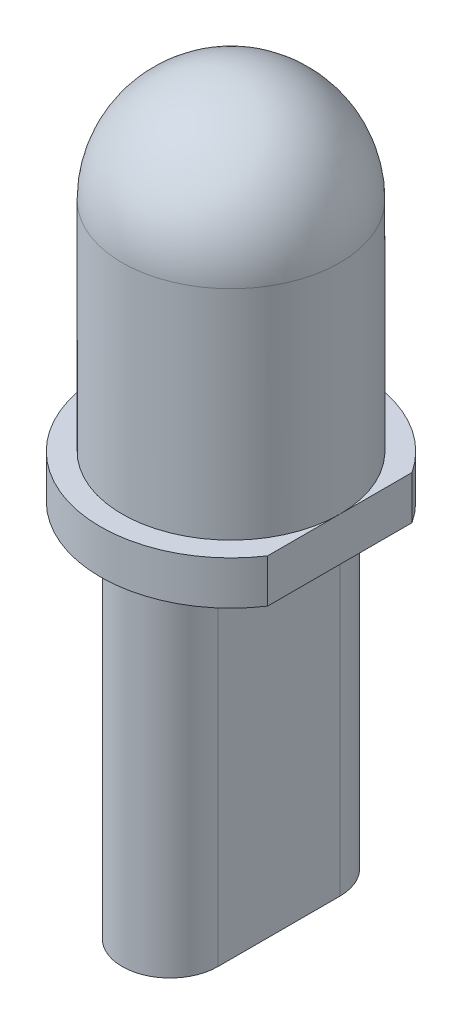
ISO-10303-21;
HEADER;
FILE_DESCRIPTION(('STEP AP214'),'2;1');
FILE_NAME('part.step','',(''),(''),'','','');
FILE_SCHEMA(('AUTOMOTIVE_DESIGN { 1 0 10303 214 1 1 1 1 }'));
ENDSEC;
DATA;
#1=APPLICATION_CONTEXT('core data for automotive mechanical design processes');
#2=APPLICATION_PROTOCOL_DEFINITION('international standard','automotive_design',2000,#1);
#3=PRODUCT_CONTEXT('',#1,'mechanical');
#4=PRODUCT('Part','Part','',(#3));
#5=PRODUCT_RELATED_PRODUCT_CATEGORY('part','',(#4));
#6=PRODUCT_DEFINITION_FORMATION('','',#4);
#7=PRODUCT_DEFINITION_CONTEXT('part definition',#1,'design');
#8=PRODUCT_DEFINITION('design','',#6,#7);
#9=PRODUCT_DEFINITION_SHAPE('','',#8);
#10=(LENGTH_UNIT() NAMED_UNIT(*) SI_UNIT(.MILLI.,.METRE.));
#11=(NAMED_UNIT(*) PLANE_ANGLE_UNIT() SI_UNIT($,.RADIAN.));
#12=(NAMED_UNIT(*) SI_UNIT($,.STERADIAN.) SOLID_ANGLE_UNIT());
#13=UNCERTAINTY_MEASURE_WITH_UNIT(LENGTH_MEASURE(1.E-05),#10,'distance_accuracy_value','');
#14=(GEOMETRIC_REPRESENTATION_CONTEXT(3) GLOBAL_UNCERTAINTY_ASSIGNED_CONTEXT((#13)) GLOBAL_UNIT_ASSIGNED_CONTEXT((#10,
#11,#12)) REPRESENTATION_CONTEXT('',''));
#15=CARTESIAN_POINT('',(0.,0.,0.));
#16=DIRECTION('',(0.,0.,1.));
#17=DIRECTION('',(1.,0.,0.));
#18=AXIS2_PLACEMENT_3D('',#15,#16,#17);
#19=CARTESIAN_POINT('',(0.,0.,0.));
#20=DIRECTION('',(0.,-1.,0.));
#21=DIRECTION('',(0.,0.,-1.));
#22=AXIS2_PLACEMENT_3D('',#19,#20,#21);
#23=PLANE('',#22);
#24=DIRECTION('',(0.,0.,1.));
#25=VECTOR('',#24,1.);
#26=CARTESIAN_POINT('',(2.5,0.,-1.6583123951777));
#27=LINE('',#26,#25);
#28=CARTESIAN_POINT('',(2.5,0.,-1.6583123951777));
#29=VERTEX_POINT('',#28);
#30=CARTESIAN_POINT('',(2.5,0.,1.6583123951777));
#31=VERTEX_POINT('',#30);
#32=EDGE_CURVE('E122',#29,#31,#27,.T.);
#33=ORIENTED_EDGE('',*,*,#32,.T.);
#34=CARTESIAN_POINT('',(0.,0.,0.));
#35=DIRECTION('',(0.,-1.,0.));
#36=DIRECTION('',(0.,0.,-1.));
#37=AXIS2_PLACEMENT_3D('',#34,#35,#36);
#38=CIRCLE('',#37,3.);
#39=EDGE_CURVE('E126',#31,#29,#38,.T.);
#40=ORIENTED_EDGE('',*,*,#39,.T.);
#41=EDGE_LOOP('',(#33,#40));
#42=FACE_BOUND('',#41,.T.);
#43=DIRECTION('',(0.,0.,-1.));
#44=VECTOR('',#43,1.);
#45=CARTESIAN_POINT('',(-1.1,0.,1.4));
#46=LINE('',#45,#44);
#47=CARTESIAN_POINT('',(-1.1,0.,1.4));
#48=VERTEX_POINT('',#47);
#49=CARTESIAN_POINT('',(-1.1,0.,-1.4));
#50=VERTEX_POINT('',#49);
#51=EDGE_CURVE('E157',#48,#50,#46,.T.);
#52=ORIENTED_EDGE('',*,*,#51,.F.);
#53=CARTESIAN_POINT('',(0.,0.,1.4));
#54=DIRECTION('',(0.,-1.,0.));
#55=DIRECTION('',(0.,0.,-1.));
#56=AXIS2_PLACEMENT_3D('',#53,#54,#55);
#57=CIRCLE('',#56,1.1);
#58=CARTESIAN_POINT('',(1.1,0.,1.4));
#59=VERTEX_POINT('',#58);
#60=EDGE_CURVE('E111',#59,#48,#57,.T.);
#61=ORIENTED_EDGE('',*,*,#60,.F.);
#62=DIRECTION('',(0.,0.,1.));
#63=VECTOR('',#62,1.);
#64=CARTESIAN_POINT('',(1.1,0.,1.4));
#65=LINE('',#64,#63);
#66=CARTESIAN_POINT('',(1.1,0.,-1.4));
#67=VERTEX_POINT('',#66);
#68=EDGE_CURVE('E107',#67,#59,#65,.T.);
#69=ORIENTED_EDGE('',*,*,#68,.F.);
#70=CARTESIAN_POINT('',(0.,0.,-1.4));
#71=DIRECTION('',(0.,-1.,0.));
#72=DIRECTION('',(0.,0.,-1.));
#73=AXIS2_PLACEMENT_3D('',#70,#71,#72);
#74=CIRCLE('',#73,1.1);
#75=EDGE_CURVE('E159',#50,#67,#74,.T.);
#76=ORIENTED_EDGE('',*,*,#75,.F.);
#77=EDGE_LOOP('',(#52,#61,#69,#76));
#78=FACE_BOUND('',#77,.T.);
#79=ADVANCED_FACE('F33',(#42,#78),#23,.T.);
#80=CARTESIAN_POINT('',(0.,6.,0.));
#81=DIRECTION('',(0.,-1.,0.));
#82=DIRECTION('',(1.,0.,0.));
#83=AXIS2_PLACEMENT_3D('',#80,#81,#82);
#84=SPHERICAL_SURFACE('',#83,2.5);
#85=CARTESIAN_POINT('',(0.,6.,0.));
#86=DIRECTION('',(0.,-1.,0.));
#87=DIRECTION('',(0.,0.,-1.));
#88=AXIS2_PLACEMENT_3D('',#85,#86,#87);
#89=CIRCLE('',#88,2.5);
#90=CARTESIAN_POINT('',(0.,6.,-2.5));
#91=VERTEX_POINT('',#90);
#92=EDGE_CURVE('E11',#91,#91,#89,.T.);
#93=ORIENTED_EDGE('',*,*,#92,.F.);
#94=EDGE_LOOP('',(#93));
#95=FACE_BOUND('',#94,.T.);
#96=ADVANCED_FACE('F140',(#95),#84,.T.);
#97=CARTESIAN_POINT('',(0.,0.,0.));
#98=DIRECTION('',(0.,-1.,0.));
#99=DIRECTION('',(0.,0.,-1.));
#100=AXIS2_PLACEMENT_3D('',#97,#98,#99);
#101=CYLINDRICAL_SURFACE('',#100,2.5);
#102=ORIENTED_EDGE('',*,*,#92,.T.);
#103=EDGE_LOOP('',(#102));
#104=FACE_BOUND('',#103,.T.);
#105=CARTESIAN_POINT('',(0.,0.999999999999999,0.));
#106=DIRECTION('',(0.,-1.,0.));
#107=DIRECTION('',(0.,0.,-1.));
#108=AXIS2_PLACEMENT_3D('',#105,#106,#107);
#109=CIRCLE('',#108,2.5);
#110=CARTESIAN_POINT('',(2.5,1.,0.));
#111=VERTEX_POINT('',#110);
#112=EDGE_CURVE('E40',#111,#111,#109,.T.);
#113=ORIENTED_EDGE('',*,*,#112,.F.);
#114=EDGE_LOOP('',(#113));
#115=FACE_BOUND('',#114,.T.);
#116=ADVANCED_FACE('F138',(#104,#115),#101,.T.);
#117=CARTESIAN_POINT('',(3.,1.,0.));
#118=DIRECTION('',(0.,1.,0.));
#119=DIRECTION('',(0.,0.,1.));
#120=AXIS2_PLACEMENT_3D('',#117,#118,#119);
#121=PLANE('',#120);
#122=DIRECTION('',(0.,0.,1.));
#123=VECTOR('',#122,1.);
#124=CARTESIAN_POINT('',(2.5,1.,-1.6583123951777));
#125=LINE('',#124,#123);
#126=CARTESIAN_POINT('',(2.5,1.,-1.6583123951777));
#127=VERTEX_POINT('',#126);
#128=EDGE_CURVE('E114',#127,#111,#125,.T.);
#129=ORIENTED_EDGE('',*,*,#128,.F.);
#130=CARTESIAN_POINT('',(0.,1.,0.));
#131=DIRECTION('',(0.,-1.,0.));
#132=DIRECTION('',(0.,0.,-1.));
#133=AXIS2_PLACEMENT_3D('',#130,#131,#132);
#134=CIRCLE('',#133,3.);
#135=CARTESIAN_POINT('',(2.5,1.,1.6583123951777));
#136=VERTEX_POINT('',#135);
#137=EDGE_CURVE('E129',#136,#127,#134,.T.);
#138=ORIENTED_EDGE('',*,*,#137,.F.);
#139=EDGE_CURVE('E55',#111,#136,#125,.T.);
#140=ORIENTED_EDGE('',*,*,#139,.F.);
#141=ORIENTED_EDGE('',*,*,#112,.T.);
#142=EDGE_LOOP('',(#129,#138,#140,#141));
#143=FACE_BOUND('',#142,.T.);
#144=ADVANCED_FACE('F135',(#143),#121,.T.);
#145=CARTESIAN_POINT('',(0.,0.,0.));
#146=DIRECTION('',(0.,-1.,0.));
#147=DIRECTION('',(0.,0.,-1.));
#148=AXIS2_PLACEMENT_3D('',#145,#146,#147);
#149=CYLINDRICAL_SURFACE('',#148,3.);
#150=DIRECTION('',(0.,1.,0.));
#151=VECTOR('',#150,1.);
#152=CARTESIAN_POINT('',(2.5,-0.000999999999999916,-1.6583123951777));
#153=LINE('',#152,#151);
#154=EDGE_CURVE('E119',#29,#127,#153,.T.);
#155=ORIENTED_EDGE('',*,*,#154,.F.);
#156=ORIENTED_EDGE('',*,*,#39,.F.);
#157=DIRECTION('',(0.,1.,0.));
#158=VECTOR('',#157,1.);
#159=CARTESIAN_POINT('',(2.5,-0.000999999999999916,1.6583123951777));
#160=LINE('',#159,#158);
#161=EDGE_CURVE('E120',#31,#136,#160,.T.);
#162=ORIENTED_EDGE('',*,*,#161,.T.);
#163=ORIENTED_EDGE('',*,*,#137,.T.);
#164=EDGE_LOOP('',(#155,#156,#162,#163));
#165=FACE_BOUND('',#164,.T.);
#166=ADVANCED_FACE('F147',(#165),#149,.T.);
#167=CARTESIAN_POINT('',(2.5,-0.000999999999999916,-1.6583123951777));
#168=DIRECTION('',(-1.,0.,0.));
#169=DIRECTION('',(0.,0.,1.));
#170=AXIS2_PLACEMENT_3D('',#167,#168,#169);
#171=PLANE('',#170);
#172=ORIENTED_EDGE('',*,*,#154,.T.);
#173=ORIENTED_EDGE('',*,*,#128,.T.);
#174=ORIENTED_EDGE('',*,*,#139,.T.);
#175=ORIENTED_EDGE('',*,*,#161,.F.);
#176=ORIENTED_EDGE('',*,*,#32,.F.);
#177=EDGE_LOOP('',(#172,#173,#174,#175,#176));
#178=FACE_BOUND('',#177,.T.);
#179=ADVANCED_FACE('F184',(#178),#171,.F.);
#180=CARTESIAN_POINT('',(0.,-8.,1.4));
#181=DIRECTION('',(0.,1.,0.));
#182=DIRECTION('',(0.,0.,1.));
#183=AXIS2_PLACEMENT_3D('',#180,#181,#182);
#184=CYLINDRICAL_SURFACE('',#183,1.1);
#185=ORIENTED_EDGE('',*,*,#60,.T.);
#186=DIRECTION('',(0.,1.,0.));
#187=VECTOR('',#186,1.);
#188=CARTESIAN_POINT('',(-1.1,-8.,1.4));
#189=LINE('',#188,#187);
#190=CARTESIAN_POINT('',(-1.1,-8.,1.4));
#191=VERTEX_POINT('',#190);
#192=EDGE_CURVE('E92',#191,#48,#189,.T.);
#193=ORIENTED_EDGE('',*,*,#192,.F.);
#194=CARTESIAN_POINT('',(0.,-8.,1.4));
#195=DIRECTION('',(0.,-1.,0.));
#196=DIRECTION('',(0.,0.,-1.));
#197=AXIS2_PLACEMENT_3D('',#194,#195,#196);
#198=CIRCLE('',#197,1.1);
#199=CARTESIAN_POINT('',(1.1,-8.,1.4));
#200=VERTEX_POINT('',#199);
#201=EDGE_CURVE('E99',#200,#191,#198,.T.);
#202=ORIENTED_EDGE('',*,*,#201,.F.);
#203=DIRECTION('',(0.,1.,0.));
#204=VECTOR('',#203,1.);
#205=CARTESIAN_POINT('',(1.1,-8.,1.4));
#206=LINE('',#205,#204);
#207=EDGE_CURVE('E166',#200,#59,#206,.T.);
#208=ORIENTED_EDGE('',*,*,#207,.T.);
#209=EDGE_LOOP('',(#185,#193,#202,#208));
#210=FACE_BOUND('',#209,.T.);
#211=ADVANCED_FACE('F109',(#210),#184,.T.);
#212=CARTESIAN_POINT('',(-1.1,-8.,1.4));
#213=DIRECTION('',(1.,0.,0.));
#214=DIRECTION('',(0.,0.,-1.));
#215=AXIS2_PLACEMENT_3D('',#212,#213,#214);
#216=PLANE('',#215);
#217=ORIENTED_EDGE('',*,*,#51,.T.);
#218=DIRECTION('',(0.,1.,0.));
#219=VECTOR('',#218,1.);
#220=CARTESIAN_POINT('',(-1.1,-8.,-1.4));
#221=LINE('',#220,#219);
#222=CARTESIAN_POINT('',(-1.1,-8.,-1.4));
#223=VERTEX_POINT('',#222);
#224=EDGE_CURVE('E95',#223,#50,#221,.T.);
#225=ORIENTED_EDGE('',*,*,#224,.F.);
#226=DIRECTION('',(0.,0.,-1.));
#227=VECTOR('',#226,1.);
#228=CARTESIAN_POINT('',(-1.1,-8.,1.4));
#229=LINE('',#228,#227);
#230=EDGE_CURVE('E88',#191,#223,#229,.T.);
#231=ORIENTED_EDGE('',*,*,#230,.F.);
#232=ORIENTED_EDGE('',*,*,#192,.T.);
#233=EDGE_LOOP('',(#217,#225,#231,#232));
#234=FACE_BOUND('',#233,.T.);
#235=ADVANCED_FACE('F90',(#234),#216,.F.);
#236=CARTESIAN_POINT('',(0.,-8.,-1.4));
#237=DIRECTION('',(0.,1.,0.));
#238=DIRECTION('',(0.,0.,1.));
#239=AXIS2_PLACEMENT_3D('',#236,#237,#238);
#240=CYLINDRICAL_SURFACE('',#239,1.1);
#241=ORIENTED_EDGE('',*,*,#75,.T.);
#242=DIRECTION('',(0.,1.,0.));
#243=VECTOR('',#242,1.);
#244=CARTESIAN_POINT('',(1.1,-8.,-1.4));
#245=LINE('',#244,#243);
#246=CARTESIAN_POINT('',(1.1,-8.,-1.4));
#247=VERTEX_POINT('',#246);
#248=EDGE_CURVE('E47',#247,#67,#245,.T.);
#249=ORIENTED_EDGE('',*,*,#248,.F.);
#250=CARTESIAN_POINT('',(0.,-8.,-1.4));
#251=DIRECTION('',(0.,-1.,0.));
#252=DIRECTION('',(0.,0.,-1.));
#253=AXIS2_PLACEMENT_3D('',#250,#251,#252);
#254=CIRCLE('',#253,1.1);
#255=EDGE_CURVE('E98',#223,#247,#254,.T.);
#256=ORIENTED_EDGE('',*,*,#255,.F.);
#257=ORIENTED_EDGE('',*,*,#224,.T.);
#258=EDGE_LOOP('',(#241,#249,#256,#257));
#259=FACE_BOUND('',#258,.T.);
#260=ADVANCED_FACE('F169',(#259),#240,.T.);
#261=CARTESIAN_POINT('',(1.1,-8.,1.4));
#262=DIRECTION('',(-1.,0.,0.));
#263=DIRECTION('',(0.,0.,1.));
#264=AXIS2_PLACEMENT_3D('',#261,#262,#263);
#265=PLANE('',#264);
#266=ORIENTED_EDGE('',*,*,#68,.T.);
#267=ORIENTED_EDGE('',*,*,#207,.F.);
#268=DIRECTION('',(0.,0.,1.));
#269=VECTOR('',#268,1.);
#270=CARTESIAN_POINT('',(1.1,-8.,1.4));
#271=LINE('',#270,#269);
#272=EDGE_CURVE('E103',#247,#200,#271,.T.);
#273=ORIENTED_EDGE('',*,*,#272,.F.);
#274=ORIENTED_EDGE('',*,*,#248,.T.);
#275=EDGE_LOOP('',(#266,#267,#273,#274));
#276=FACE_BOUND('',#275,.T.);
#277=ADVANCED_FACE('F170',(#276),#265,.F.);
#278=CARTESIAN_POINT('',(0.,-8.,1.4));
#279=DIRECTION('',(0.,-1.,0.));
#280=DIRECTION('',(0.,0.,-1.));
#281=AXIS2_PLACEMENT_3D('',#278,#279,#280);
#282=PLANE('',#281);
#283=ORIENTED_EDGE('',*,*,#201,.T.);
#284=ORIENTED_EDGE('',*,*,#230,.T.);
#285=ORIENTED_EDGE('',*,*,#255,.T.);
#286=ORIENTED_EDGE('',*,*,#272,.T.);
#287=EDGE_LOOP('',(#283,#284,#285,#286));
#288=FACE_BOUND('',#287,.T.);
#289=ADVANCED_FACE('F102',(#288),#282,.T.);
#290=CLOSED_SHELL('',(#79,#96,#116,#144,#166,#179,#211,#235,#260,#277,#289));
#291=MANIFOLD_SOLID_BREP('B2',#290);
#292=ADVANCED_BREP_SHAPE_REPRESENTATION('',(#18,#291),#14);
#293=SHAPE_DEFINITION_REPRESENTATION(#9,#292);
ENDSEC;
END-ISO-10303-21;
